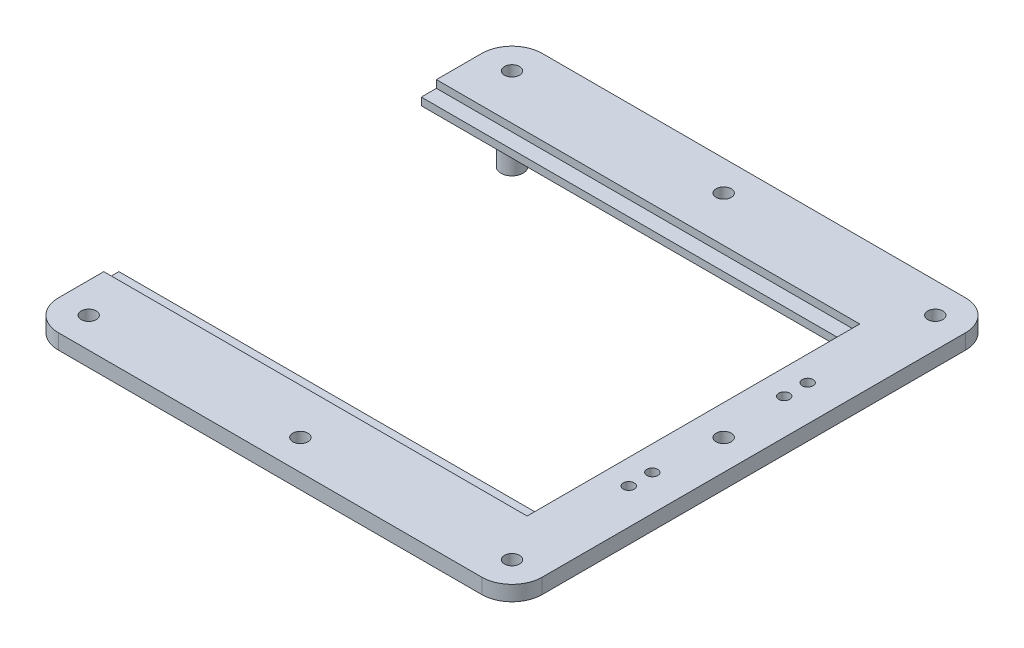
ISO-10303-21;
HEADER;
FILE_DESCRIPTION(('STEP AP214'),'2;1');
FILE_NAME('part.step','',(''),(''),'','','');
FILE_SCHEMA(('AUTOMOTIVE_DESIGN { 1 0 10303 214 1 1 1 1 }'));
ENDSEC;
DATA;
#1=APPLICATION_CONTEXT('core data for automotive mechanical design processes');
#2=APPLICATION_PROTOCOL_DEFINITION('international standard','automotive_design',2000,#1);
#3=PRODUCT_CONTEXT('',#1,'mechanical');
#4=PRODUCT('Part','Part','',(#3));
#5=PRODUCT_RELATED_PRODUCT_CATEGORY('part','',(#4));
#6=PRODUCT_DEFINITION_FORMATION('','',#4);
#7=PRODUCT_DEFINITION_CONTEXT('part definition',#1,'design');
#8=PRODUCT_DEFINITION('design','',#6,#7);
#9=PRODUCT_DEFINITION_SHAPE('','',#8);
#10=(LENGTH_UNIT() NAMED_UNIT(*) SI_UNIT(.MILLI.,.METRE.));
#11=(NAMED_UNIT(*) PLANE_ANGLE_UNIT() SI_UNIT($,.RADIAN.));
#12=(NAMED_UNIT(*) SI_UNIT($,.STERADIAN.) SOLID_ANGLE_UNIT());
#13=UNCERTAINTY_MEASURE_WITH_UNIT(LENGTH_MEASURE(1.E-05),#10,'distance_accuracy_value','');
#14=(GEOMETRIC_REPRESENTATION_CONTEXT(3) GLOBAL_UNCERTAINTY_ASSIGNED_CONTEXT((#13)) GLOBAL_UNIT_ASSIGNED_CONTEXT((#10,
#11,#12)) REPRESENTATION_CONTEXT('',''));
#15=CARTESIAN_POINT('',(0.,0.,0.));
#16=DIRECTION('',(0.,0.,1.));
#17=DIRECTION('',(1.,0.,0.));
#18=AXIS2_PLACEMENT_3D('',#15,#16,#17);
#19=CARTESIAN_POINT('',(177.8,6.35,0.));
#20=DIRECTION('',(0.,0.,-1.));
#21=DIRECTION('',(-1.,0.,0.));
#22=AXIS2_PLACEMENT_3D('',#19,#20,#21);
#23=PLANE('',#22);
#24=DIRECTION('',(0.,-1.,0.));
#25=VECTOR('',#24,1.);
#26=CARTESIAN_POINT('',(177.8,6.35,0.));
#27=LINE('',#26,#25);
#28=CARTESIAN_POINT('',(177.8,3.175,0.));
#29=VERTEX_POINT('',#28);
#30=CARTESIAN_POINT('',(177.8,0.,0.));
#31=VERTEX_POINT('',#30);
#32=EDGE_CURVE('E11',#29,#31,#27,.T.);
#33=ORIENTED_EDGE('',*,*,#32,.F.);
#34=DIRECTION('',(1.,0.,0.));
#35=VECTOR('',#34,1.);
#36=CARTESIAN_POINT('',(177.8,3.175,0.));
#37=LINE('',#36,#35);
#38=CARTESIAN_POINT('',(1.08197495753343E-13,3.175,0.));
#39=VERTEX_POINT('',#38);
#40=EDGE_CURVE('E310',#39,#29,#37,.T.);
#41=ORIENTED_EDGE('',*,*,#40,.F.);
#42=DIRECTION('',(0.,-1.,0.));
#43=VECTOR('',#42,1.);
#44=CARTESIAN_POINT('',(0.,6.35,0.));
#45=LINE('',#44,#43);
#46=CARTESIAN_POINT('',(0.,0.,0.));
#47=VERTEX_POINT('',#46);
#48=EDGE_CURVE('E109',#39,#47,#45,.T.);
#49=ORIENTED_EDGE('',*,*,#48,.T.);
#50=DIRECTION('',(1.,0.,0.));
#51=VECTOR('',#50,1.);
#52=CARTESIAN_POINT('',(177.8,0.,0.));
#53=LINE('',#52,#51);
#54=EDGE_CURVE('E169',#47,#31,#53,.T.);
#55=ORIENTED_EDGE('',*,*,#54,.T.);
#56=EDGE_LOOP('',(#33,#41,#49,#55));
#57=FACE_BOUND('',#56,.T.);
#58=ADVANCED_FACE('F38',(#57),#23,.F.);
#59=CARTESIAN_POINT('',(177.8,6.35,127.));
#60=DIRECTION('',(1.,0.,0.));
#61=DIRECTION('',(0.,0.,-1.));
#62=AXIS2_PLACEMENT_3D('',#59,#60,#61);
#63=PLANE('',#62);
#64=DIRECTION('',(0.,0.,1.));
#65=VECTOR('',#64,1.);
#66=CARTESIAN_POINT('',(177.8,0.,127.));
#67=LINE('',#66,#65);
#68=CARTESIAN_POINT('',(177.8,0.,127.));
#69=VERTEX_POINT('',#68);
#70=EDGE_CURVE('E172',#31,#69,#67,.T.);
#71=ORIENTED_EDGE('',*,*,#70,.T.);
#72=DIRECTION('',(0.,-1.,0.));
#73=VECTOR('',#72,1.);
#74=CARTESIAN_POINT('',(177.8,6.35,127.));
#75=LINE('',#74,#73);
#76=CARTESIAN_POINT('',(177.8,3.175,127.));
#77=VERTEX_POINT('',#76);
#78=EDGE_CURVE('E47',#77,#69,#75,.T.);
#79=ORIENTED_EDGE('',*,*,#78,.F.);
#80=DIRECTION('',(0.,0.,-1.));
#81=VECTOR('',#80,1.);
#82=CARTESIAN_POINT('',(177.8,3.175,127.));
#83=LINE('',#82,#81);
#84=CARTESIAN_POINT('',(177.8,3.175,133.35));
#85=VERTEX_POINT('',#84);
#86=EDGE_CURVE('E283',#85,#77,#83,.T.);
#87=ORIENTED_EDGE('',*,*,#86,.F.);
#88=DIRECTION('',(0.,1.,0.));
#89=VECTOR('',#88,1.);
#90=CARTESIAN_POINT('',(177.8,3.175,133.35));
#91=LINE('',#90,#89);
#92=CARTESIAN_POINT('',(177.8,6.35,133.35));
#93=VERTEX_POINT('',#92);
#94=EDGE_CURVE('E303',#85,#93,#91,.T.);
#95=ORIENTED_EDGE('',*,*,#94,.T.);
#96=DIRECTION('',(0.,0.,1.));
#97=VECTOR('',#96,1.);
#98=CARTESIAN_POINT('',(177.8,6.35,127.));
#99=LINE('',#98,#97);
#100=CARTESIAN_POINT('',(177.8,6.35,-6.35000000000002));
#101=VERTEX_POINT('',#100);
#102=EDGE_CURVE('E207',#101,#93,#99,.T.);
#103=ORIENTED_EDGE('',*,*,#102,.F.);
#104=DIRECTION('',(0.,1.,0.));
#105=VECTOR('',#104,1.);
#106=CARTESIAN_POINT('',(177.8,3.175,-6.35000000000002));
#107=LINE('',#106,#105);
#108=CARTESIAN_POINT('',(177.8,3.175,-6.35000000000002));
#109=VERTEX_POINT('',#108);
#110=EDGE_CURVE('E326',#109,#101,#107,.T.);
#111=ORIENTED_EDGE('',*,*,#110,.F.);
#112=DIRECTION('',(0.,0.,-1.));
#113=VECTOR('',#112,1.);
#114=CARTESIAN_POINT('',(177.8,3.175,0.));
#115=LINE('',#114,#113);
#116=EDGE_CURVE('E314',#29,#109,#115,.T.);
#117=ORIENTED_EDGE('',*,*,#116,.F.);
#118=ORIENTED_EDGE('',*,*,#32,.T.);
#119=EDGE_LOOP('',(#71,#79,#87,#95,#103,#111,#117,#118));
#120=FACE_BOUND('',#119,.T.);
#121=ADVANCED_FACE('F474',(#120),#63,.F.);
#122=CARTESIAN_POINT('',(0.,6.35,127.));
#123=DIRECTION('',(0.,0.,1.));
#124=DIRECTION('',(1.,0.,0.));
#125=AXIS2_PLACEMENT_3D('',#122,#123,#124);
#126=PLANE('',#125);
#127=DIRECTION('',(0.,-1.,0.));
#128=VECTOR('',#127,1.);
#129=CARTESIAN_POINT('',(0.,6.35,127.));
#130=LINE('',#129,#128);
#131=CARTESIAN_POINT('',(0.,3.175,127.));
#132=VERTEX_POINT('',#131);
#133=CARTESIAN_POINT('',(0.,0.,127.));
#134=VERTEX_POINT('',#133);
#135=EDGE_CURVE('E234',#132,#134,#130,.T.);
#136=ORIENTED_EDGE('',*,*,#135,.F.);
#137=DIRECTION('',(-1.,0.,0.));
#138=VECTOR('',#137,1.);
#139=CARTESIAN_POINT('',(177.8,3.175,127.));
#140=LINE('',#139,#138);
#141=EDGE_CURVE('E287',#77,#132,#140,.T.);
#142=ORIENTED_EDGE('',*,*,#141,.F.);
#143=ORIENTED_EDGE('',*,*,#78,.T.);
#144=DIRECTION('',(-1.,0.,0.));
#145=VECTOR('',#144,1.);
#146=CARTESIAN_POINT('',(0.,0.,127.));
#147=LINE('',#146,#145);
#148=EDGE_CURVE('E177',#69,#134,#147,.T.);
#149=ORIENTED_EDGE('',*,*,#148,.T.);
#150=EDGE_LOOP('',(#136,#142,#143,#149));
#151=FACE_BOUND('',#150,.T.);
#152=ADVANCED_FACE('F478',(#151),#126,.F.);
#153=CARTESIAN_POINT('',(0.,6.35,152.4));
#154=DIRECTION('',(1.,0.,0.));
#155=DIRECTION('',(0.,0.,-1.));
#156=AXIS2_PLACEMENT_3D('',#153,#154,#155);
#157=PLANE('',#156);
#158=DIRECTION('',(0.,0.,1.));
#159=VECTOR('',#158,1.);
#160=CARTESIAN_POINT('',(0.,6.35,152.4));
#161=LINE('',#160,#159);
#162=CARTESIAN_POINT('',(0.,6.35,133.35));
#163=VERTEX_POINT('',#162);
#164=CARTESIAN_POINT('',(0.,6.35,152.4));
#165=VERTEX_POINT('',#164);
#166=EDGE_CURVE('E116',#163,#165,#161,.T.);
#167=ORIENTED_EDGE('',*,*,#166,.F.);
#168=DIRECTION('',(0.,1.,0.));
#169=VECTOR('',#168,1.);
#170=CARTESIAN_POINT('',(0.,3.175,133.35));
#171=LINE('',#170,#169);
#172=CARTESIAN_POINT('',(0.,3.175,133.35));
#173=VERTEX_POINT('',#172);
#174=EDGE_CURVE('E55',#173,#163,#171,.T.);
#175=ORIENTED_EDGE('',*,*,#174,.F.);
#176=DIRECTION('',(0.,0.,1.));
#177=VECTOR('',#176,1.);
#178=CARTESIAN_POINT('',(0.,3.175,127.));
#179=LINE('',#178,#177);
#180=EDGE_CURVE('E292',#132,#173,#179,.T.);
#181=ORIENTED_EDGE('',*,*,#180,.F.);
#182=ORIENTED_EDGE('',*,*,#135,.T.);
#183=DIRECTION('',(0.,0.,1.));
#184=VECTOR('',#183,1.);
#185=CARTESIAN_POINT('',(0.,0.,152.4));
#186=LINE('',#185,#184);
#187=CARTESIAN_POINT('',(0.,0.,152.4));
#188=VERTEX_POINT('',#187);
#189=EDGE_CURVE('E181',#134,#188,#186,.T.);
#190=ORIENTED_EDGE('',*,*,#189,.T.);
#191=DIRECTION('',(0.,-1.,0.));
#192=VECTOR('',#191,1.);
#193=CARTESIAN_POINT('',(0.,6.35,152.4));
#194=LINE('',#193,#192);
#195=EDGE_CURVE('E230',#165,#188,#194,.T.);
#196=ORIENTED_EDGE('',*,*,#195,.F.);
#197=EDGE_LOOP('',(#167,#175,#181,#182,#190,#196));
#198=FACE_BOUND('',#197,.T.);
#199=ADVANCED_FACE('F805',(#198),#157,.F.);
#200=CARTESIAN_POINT('',(12.7,6.35,152.4));
#201=DIRECTION('',(0.,-1.,0.));
#202=DIRECTION('',(0.,0.,-1.));
#203=AXIS2_PLACEMENT_3D('',#200,#201,#202);
#204=CYLINDRICAL_SURFACE('',#203,12.7);
#205=CARTESIAN_POINT('',(12.7,0.,152.4));
#206=DIRECTION('',(0.,1.,0.));
#207=DIRECTION('',(0.,0.,-1.));
#208=AXIS2_PLACEMENT_3D('',#205,#206,#207);
#209=CIRCLE('',#208,12.7);
#210=CARTESIAN_POINT('',(12.7000000000001,0.,165.1));
#211=VERTEX_POINT('',#210);
#212=EDGE_CURVE('E184',#188,#211,#209,.T.);
#213=ORIENTED_EDGE('',*,*,#212,.T.);
#214=DIRECTION('',(0.,-1.,0.));
#215=VECTOR('',#214,1.);
#216=CARTESIAN_POINT('',(12.7000000000001,6.35,165.1));
#217=LINE('',#216,#215);
#218=CARTESIAN_POINT('',(12.7000000000001,6.35,165.1));
#219=VERTEX_POINT('',#218);
#220=EDGE_CURVE('E226',#219,#211,#217,.T.);
#221=ORIENTED_EDGE('',*,*,#220,.F.);
#222=CARTESIAN_POINT('',(12.7,6.35,152.4));
#223=DIRECTION('',(0.,1.,0.));
#224=DIRECTION('',(0.,0.,-1.));
#225=AXIS2_PLACEMENT_3D('',#222,#223,#224);
#226=CIRCLE('',#225,12.7);
#227=EDGE_CURVE('E402',#165,#219,#226,.T.);
#228=ORIENTED_EDGE('',*,*,#227,.F.);
#229=ORIENTED_EDGE('',*,*,#195,.T.);
#230=EDGE_LOOP('',(#213,#221,#228,#229));
#231=FACE_BOUND('',#230,.T.);
#232=ADVANCED_FACE('F813',(#231),#204,.T.);
#233=CARTESIAN_POINT('',(190.5,6.35,165.1));
#234=DIRECTION('',(0.,0.,-1.));
#235=DIRECTION('',(-1.,0.,0.));
#236=AXIS2_PLACEMENT_3D('',#233,#234,#235);
#237=PLANE('',#236);
#238=DIRECTION('',(1.,0.,0.));
#239=VECTOR('',#238,1.);
#240=CARTESIAN_POINT('',(190.5,0.,165.1));
#241=LINE('',#240,#239);
#242=CARTESIAN_POINT('',(190.5,0.,165.1));
#243=VERTEX_POINT('',#242);
#244=EDGE_CURVE('E187',#211,#243,#241,.T.);
#245=ORIENTED_EDGE('',*,*,#244,.T.);
#246=DIRECTION('',(0.,-1.,0.));
#247=VECTOR('',#246,1.);
#248=CARTESIAN_POINT('',(190.5,6.35,165.1));
#249=LINE('',#248,#247);
#250=CARTESIAN_POINT('',(190.5,6.35,165.1));
#251=VERTEX_POINT('',#250);
#252=EDGE_CURVE('E222',#251,#243,#249,.T.);
#253=ORIENTED_EDGE('',*,*,#252,.F.);
#254=DIRECTION('',(1.,0.,0.));
#255=VECTOR('',#254,1.);
#256=CARTESIAN_POINT('',(190.5,6.35,165.1));
#257=LINE('',#256,#255);
#258=EDGE_CURVE('E405',#219,#251,#257,.T.);
#259=ORIENTED_EDGE('',*,*,#258,.F.);
#260=ORIENTED_EDGE('',*,*,#220,.T.);
#261=EDGE_LOOP('',(#245,#253,#259,#260));
#262=FACE_BOUND('',#261,.T.);
#263=ADVANCED_FACE('F824',(#262),#237,.F.);
#264=CARTESIAN_POINT('',(190.5,6.35,152.4));
#265=DIRECTION('',(0.,-1.,0.));
#266=DIRECTION('',(0.,0.,-1.));
#267=AXIS2_PLACEMENT_3D('',#264,#265,#266);
#268=CYLINDRICAL_SURFACE('',#267,12.7);
#269=CARTESIAN_POINT('',(190.5,0.,152.4));
#270=DIRECTION('',(0.,1.,0.));
#271=DIRECTION('',(0.,0.,-1.));
#272=AXIS2_PLACEMENT_3D('',#269,#270,#271);
#273=CIRCLE('',#272,12.7);
#274=CARTESIAN_POINT('',(203.2,0.,152.4));
#275=VERTEX_POINT('',#274);
#276=EDGE_CURVE('E190',#243,#275,#273,.T.);
#277=ORIENTED_EDGE('',*,*,#276,.T.);
#278=DIRECTION('',(0.,-1.,0.));
#279=VECTOR('',#278,1.);
#280=CARTESIAN_POINT('',(203.2,6.35,152.4));
#281=LINE('',#280,#279);
#282=CARTESIAN_POINT('',(203.2,6.35,152.4));
#283=VERTEX_POINT('',#282);
#284=EDGE_CURVE('E218',#283,#275,#281,.T.);
#285=ORIENTED_EDGE('',*,*,#284,.F.);
#286=CARTESIAN_POINT('',(190.5,6.35,152.4));
#287=DIRECTION('',(0.,1.,0.));
#288=DIRECTION('',(0.,0.,-1.));
#289=AXIS2_PLACEMENT_3D('',#286,#287,#288);
#290=CIRCLE('',#289,12.7);
#291=EDGE_CURVE('E408',#251,#283,#290,.T.);
#292=ORIENTED_EDGE('',*,*,#291,.F.);
#293=ORIENTED_EDGE('',*,*,#252,.T.);
#294=EDGE_LOOP('',(#277,#285,#292,#293));
#295=FACE_BOUND('',#294,.T.);
#296=ADVANCED_FACE('F831',(#295),#268,.T.);
#297=CARTESIAN_POINT('',(203.2,6.35,-25.3999999999999));
#298=DIRECTION('',(-1.,0.,0.));
#299=DIRECTION('',(0.,0.,1.));
#300=AXIS2_PLACEMENT_3D('',#297,#298,#299);
#301=PLANE('',#300);
#302=DIRECTION('',(0.,0.,-1.));
#303=VECTOR('',#302,1.);
#304=CARTESIAN_POINT('',(203.2,0.,-25.3999999999999));
#305=LINE('',#304,#303);
#306=CARTESIAN_POINT('',(203.2,0.,-25.3999999999999));
#307=VERTEX_POINT('',#306);
#308=EDGE_CURVE('E193',#275,#307,#305,.T.);
#309=ORIENTED_EDGE('',*,*,#308,.T.);
#310=DIRECTION('',(0.,-1.,0.));
#311=VECTOR('',#310,1.);
#312=CARTESIAN_POINT('',(203.2,6.35,-25.3999999999999));
#313=LINE('',#312,#311);
#314=CARTESIAN_POINT('',(203.2,6.35,-25.3999999999999));
#315=VERTEX_POINT('',#314);
#316=EDGE_CURVE('E155',#315,#307,#313,.T.);
#317=ORIENTED_EDGE('',*,*,#316,.F.);
#318=DIRECTION('',(0.,0.,-1.));
#319=VECTOR('',#318,1.);
#320=CARTESIAN_POINT('',(203.2,6.35,-25.3999999999999));
#321=LINE('',#320,#319);
#322=EDGE_CURVE('E141',#283,#315,#321,.T.);
#323=ORIENTED_EDGE('',*,*,#322,.F.);
#324=ORIENTED_EDGE('',*,*,#284,.T.);
#325=EDGE_LOOP('',(#309,#317,#323,#324));
#326=FACE_BOUND('',#325,.T.);
#327=ADVANCED_FACE('F839',(#326),#301,.F.);
#328=CARTESIAN_POINT('',(190.5,6.35,-25.4));
#329=DIRECTION('',(0.,-1.,0.));
#330=DIRECTION('',(0.,0.,-1.));
#331=AXIS2_PLACEMENT_3D('',#328,#329,#330);
#332=CYLINDRICAL_SURFACE('',#331,12.7);
#333=CARTESIAN_POINT('',(190.5,0.,-25.4));
#334=DIRECTION('',(0.,1.,0.));
#335=DIRECTION('',(0.,0.,-1.));
#336=AXIS2_PLACEMENT_3D('',#333,#334,#335);
#337=CIRCLE('',#336,12.7);
#338=CARTESIAN_POINT('',(190.5,0.,-38.1));
#339=VERTEX_POINT('',#338);
#340=EDGE_CURVE('E151',#307,#339,#337,.T.);
#341=ORIENTED_EDGE('',*,*,#340,.T.);
#342=DIRECTION('',(0.,-1.,0.));
#343=VECTOR('',#342,1.);
#344=CARTESIAN_POINT('',(190.5,6.35,-38.1));
#345=LINE('',#344,#343);
#346=CARTESIAN_POINT('',(190.5,6.35,-38.1));
#347=VERTEX_POINT('',#346);
#348=EDGE_CURVE('E148',#347,#339,#345,.T.);
#349=ORIENTED_EDGE('',*,*,#348,.F.);
#350=CARTESIAN_POINT('',(190.5,6.35,-25.4));
#351=DIRECTION('',(0.,1.,0.));
#352=DIRECTION('',(0.,0.,-1.));
#353=AXIS2_PLACEMENT_3D('',#350,#351,#352);
#354=CIRCLE('',#353,12.7);
#355=EDGE_CURVE('E133',#315,#347,#354,.T.);
#356=ORIENTED_EDGE('',*,*,#355,.F.);
#357=ORIENTED_EDGE('',*,*,#316,.T.);
#358=EDGE_LOOP('',(#341,#349,#356,#357));
#359=FACE_BOUND('',#358,.T.);
#360=ADVANCED_FACE('F149',(#359),#332,.T.);
#361=CARTESIAN_POINT('',(12.7000000000001,6.35,-38.1));
#362=DIRECTION('',(0.,0.,1.));
#363=DIRECTION('',(1.,0.,0.));
#364=AXIS2_PLACEMENT_3D('',#361,#362,#363);
#365=PLANE('',#364);
#366=DIRECTION('',(-1.,0.,0.));
#367=VECTOR('',#366,1.);
#368=CARTESIAN_POINT('',(12.7000000000001,0.,-38.1));
#369=LINE('',#368,#367);
#370=CARTESIAN_POINT('',(12.7,0.,-38.1));
#371=VERTEX_POINT('',#370);
#372=EDGE_CURVE('E198',#339,#371,#369,.T.);
#373=ORIENTED_EDGE('',*,*,#372,.T.);
#374=DIRECTION('',(0.,-1.,0.));
#375=VECTOR('',#374,1.);
#376=CARTESIAN_POINT('',(12.7,6.35,-38.1));
#377=LINE('',#376,#375);
#378=CARTESIAN_POINT('',(12.7,6.35,-38.1));
#379=VERTEX_POINT('',#378);
#380=EDGE_CURVE('E156',#379,#371,#377,.T.);
#381=ORIENTED_EDGE('',*,*,#380,.F.);
#382=DIRECTION('',(-1.,0.,0.));
#383=VECTOR('',#382,1.);
#384=CARTESIAN_POINT('',(12.7000000000001,6.35,-38.1));
#385=LINE('',#384,#383);
#386=EDGE_CURVE('E138',#347,#379,#385,.T.);
#387=ORIENTED_EDGE('',*,*,#386,.F.);
#388=ORIENTED_EDGE('',*,*,#348,.T.);
#389=EDGE_LOOP('',(#373,#381,#387,#388));
#390=FACE_BOUND('',#389,.T.);
#391=ADVANCED_FACE('F158',(#390),#365,.F.);
#392=CARTESIAN_POINT('',(12.7,6.35,-25.4));
#393=DIRECTION('',(0.,-1.,0.));
#394=DIRECTION('',(0.,0.,-1.));
#395=AXIS2_PLACEMENT_3D('',#392,#393,#394);
#396=CYLINDRICAL_SURFACE('',#395,12.7);
#397=CARTESIAN_POINT('',(12.7,0.,-25.4));
#398=DIRECTION('',(0.,1.,0.));
#399=DIRECTION('',(0.,0.,-1.));
#400=AXIS2_PLACEMENT_3D('',#397,#398,#399);
#401=CIRCLE('',#400,12.7);
#402=CARTESIAN_POINT('',(0.,0.,-25.3999999999999));
#403=VERTEX_POINT('',#402);
#404=EDGE_CURVE('E201',#371,#403,#401,.T.);
#405=ORIENTED_EDGE('',*,*,#404,.T.);
#406=DIRECTION('',(0.,-1.,0.));
#407=VECTOR('',#406,1.);
#408=CARTESIAN_POINT('',(0.,6.35,-25.3999999999999));
#409=LINE('',#408,#407);
#410=CARTESIAN_POINT('',(0.,6.35,-25.3999999999999));
#411=VERTEX_POINT('',#410);
#412=EDGE_CURVE('E210',#411,#403,#409,.T.);
#413=ORIENTED_EDGE('',*,*,#412,.F.);
#414=CARTESIAN_POINT('',(12.7,6.35,-25.4));
#415=DIRECTION('',(0.,1.,0.));
#416=DIRECTION('',(0.,0.,-1.));
#417=AXIS2_PLACEMENT_3D('',#414,#415,#416);
#418=CIRCLE('',#417,12.7);
#419=EDGE_CURVE('E64',#379,#411,#418,.T.);
#420=ORIENTED_EDGE('',*,*,#419,.F.);
#421=ORIENTED_EDGE('',*,*,#380,.T.);
#422=EDGE_LOOP('',(#405,#413,#420,#421));
#423=FACE_BOUND('',#422,.T.);
#424=ADVANCED_FACE('F860',(#423),#396,.T.);
#425=CARTESIAN_POINT('',(0.,6.35,0.));
#426=DIRECTION('',(1.,0.,0.));
#427=DIRECTION('',(0.,0.,-1.));
#428=AXIS2_PLACEMENT_3D('',#425,#426,#427);
#429=PLANE('',#428);
#430=DIRECTION('',(0.,0.,1.));
#431=VECTOR('',#430,1.);
#432=CARTESIAN_POINT('',(1.08197495753343E-13,3.175,0.));
#433=LINE('',#432,#431);
#434=CARTESIAN_POINT('',(1.06356398157764E-13,3.175,-6.35000000000005));
#435=VERTEX_POINT('',#434);
#436=EDGE_CURVE('E322',#435,#39,#433,.T.);
#437=ORIENTED_EDGE('',*,*,#436,.F.);
#438=DIRECTION('',(0.,1.,0.));
#439=VECTOR('',#438,1.);
#440=CARTESIAN_POINT('',(1.06356398157764E-13,3.175,-6.35000000000005));
#441=LINE('',#440,#439);
#442=CARTESIAN_POINT('',(1.06356398157764E-13,6.35,-6.35000000000005));
#443=VERTEX_POINT('',#442);
#444=EDGE_CURVE('E302',#435,#443,#441,.T.);
#445=ORIENTED_EDGE('',*,*,#444,.T.);
#446=DIRECTION('',(0.,0.,1.));
#447=VECTOR('',#446,1.);
#448=CARTESIAN_POINT('',(0.,6.35,0.));
#449=LINE('',#448,#447);
#450=EDGE_CURVE('E163',#411,#443,#449,.T.);
#451=ORIENTED_EDGE('',*,*,#450,.F.);
#452=ORIENTED_EDGE('',*,*,#412,.T.);
#453=DIRECTION('',(0.,0.,1.));
#454=VECTOR('',#453,1.);
#455=CARTESIAN_POINT('',(0.,0.,0.));
#456=LINE('',#455,#454);
#457=EDGE_CURVE('E204',#403,#47,#456,.T.);
#458=ORIENTED_EDGE('',*,*,#457,.T.);
#459=ORIENTED_EDGE('',*,*,#48,.F.);
#460=EDGE_LOOP('',(#437,#445,#451,#452,#458,#459));
#461=FACE_BOUND('',#460,.T.);
#462=ADVANCED_FACE('F436',(#461),#429,.F.);
#463=CARTESIAN_POINT('',(12.7,6.35,-25.4));
#464=DIRECTION('',(0.,-1.,0.));
#465=DIRECTION('',(0.,0.,-1.));
#466=AXIS2_PLACEMENT_3D('',#463,#464,#465);
#467=PLANE('',#466);
#468=CARTESIAN_POINT('',(101.6,6.35,-25.4));
#469=DIRECTION('',(0.,1.,0.));
#470=DIRECTION('',(0.,0.,1.));
#471=AXIS2_PLACEMENT_3D('',#468,#469,#470);
#472=CIRCLE('',#471,3.175);
#473=CARTESIAN_POINT('',(101.6,6.35,-22.225));
#474=VERTEX_POINT('',#473);
#475=EDGE_CURVE('E261',#474,#474,#472,.T.);
#476=ORIENTED_EDGE('',*,*,#475,.F.);
#477=EDGE_LOOP('',(#476));
#478=FACE_BOUND('',#477,.T.);
#479=CARTESIAN_POINT('',(190.500000000001,6.35,63.4999999999985));
#480=DIRECTION('',(0.,1.,0.));
#481=DIRECTION('',(0.,0.,1.));
#482=AXIS2_PLACEMENT_3D('',#479,#480,#481);
#483=CIRCLE('',#482,3.175);
#484=CARTESIAN_POINT('',(190.500000000001,6.35,66.6749999999985));
#485=VERTEX_POINT('',#484);
#486=EDGE_CURVE('E423',#485,#485,#483,.T.);
#487=ORIENTED_EDGE('',*,*,#486,.F.);
#488=EDGE_LOOP('',(#487));
#489=FACE_BOUND('',#488,.T.);
#490=CARTESIAN_POINT('',(101.600000000003,6.35,152.4));
#491=DIRECTION('',(0.,1.,0.));
#492=DIRECTION('',(0.,0.,1.));
#493=AXIS2_PLACEMENT_3D('',#490,#491,#492);
#494=CIRCLE('',#493,3.175);
#495=CARTESIAN_POINT('',(101.600000000003,6.35,155.575));
#496=VERTEX_POINT('',#495);
#497=EDGE_CURVE('E419',#496,#496,#494,.T.);
#498=ORIENTED_EDGE('',*,*,#497,.F.);
#499=EDGE_LOOP('',(#498));
#500=FACE_BOUND('',#499,.T.);
#501=CARTESIAN_POINT('',(188.214,6.35,101.092));
#502=DIRECTION('',(0.,1.,0.));
#503=DIRECTION('',(0.,0.,1.));
#504=AXIS2_PLACEMENT_3D('',#501,#502,#503);
#505=CIRCLE('',#504,2.28600000000001);
#506=CARTESIAN_POINT('',(188.214,6.35,103.378));
#507=VERTEX_POINT('',#506);
#508=EDGE_CURVE('E244',#507,#507,#505,.T.);
#509=ORIENTED_EDGE('',*,*,#508,.F.);
#510=EDGE_LOOP('',(#509));
#511=FACE_BOUND('',#510,.T.);
#512=CARTESIAN_POINT('',(188.214,6.35,91.186));
#513=DIRECTION('',(0.,1.,0.));
#514=DIRECTION('',(0.,0.,1.));
#515=AXIS2_PLACEMENT_3D('',#512,#513,#514);
#516=CIRCLE('',#515,2.28600000000001);
#517=CARTESIAN_POINT('',(188.214,6.35,93.472));
#518=VERTEX_POINT('',#517);
#519=EDGE_CURVE('E279',#518,#518,#516,.T.);
#520=ORIENTED_EDGE('',*,*,#519,.F.);
#521=EDGE_LOOP('',(#520));
#522=FACE_BOUND('',#521,.T.);
#523=CARTESIAN_POINT('',(188.214,6.35,35.814));
#524=DIRECTION('',(0.,1.,0.));
#525=DIRECTION('',(0.,0.,1.));
#526=AXIS2_PLACEMENT_3D('',#523,#524,#525);
#527=CIRCLE('',#526,2.28600000000001);
#528=CARTESIAN_POINT('',(188.214,6.35,38.1));
#529=VERTEX_POINT('',#528);
#530=EDGE_CURVE('E273',#529,#529,#527,.T.);
#531=ORIENTED_EDGE('',*,*,#530,.F.);
#532=EDGE_LOOP('',(#531));
#533=FACE_BOUND('',#532,.T.);
#534=CARTESIAN_POINT('',(188.214,6.35,25.908));
#535=DIRECTION('',(0.,1.,0.));
#536=DIRECTION('',(0.,0.,1.));
#537=AXIS2_PLACEMENT_3D('',#534,#535,#536);
#538=CIRCLE('',#537,2.28600000000001);
#539=CARTESIAN_POINT('',(188.214,6.35,28.194));
#540=VERTEX_POINT('',#539);
#541=EDGE_CURVE('E268',#540,#540,#538,.T.);
#542=ORIENTED_EDGE('',*,*,#541,.F.);
#543=EDGE_LOOP('',(#542));
#544=FACE_BOUND('',#543,.T.);
#545=CARTESIAN_POINT('',(12.7,6.35,152.4));
#546=DIRECTION('',(0.,1.,0.));
#547=DIRECTION('',(0.,0.,1.));
#548=AXIS2_PLACEMENT_3D('',#545,#546,#547);
#549=CIRCLE('',#548,3.175);
#550=CARTESIAN_POINT('',(12.7,6.35,155.575));
#551=VERTEX_POINT('',#550);
#552=EDGE_CURVE('E364',#551,#551,#549,.T.);
#553=ORIENTED_EDGE('',*,*,#552,.F.);
#554=EDGE_LOOP('',(#553));
#555=FACE_BOUND('',#554,.T.);
#556=CARTESIAN_POINT('',(190.5,6.35,152.4));
#557=DIRECTION('',(0.,1.,0.));
#558=DIRECTION('',(0.,0.,1.));
#559=AXIS2_PLACEMENT_3D('',#556,#557,#558);
#560=CIRCLE('',#559,3.175);
#561=CARTESIAN_POINT('',(190.5,6.35,155.575));
#562=VERTEX_POINT('',#561);
#563=EDGE_CURVE('E381',#562,#562,#560,.T.);
#564=ORIENTED_EDGE('',*,*,#563,.F.);
#565=EDGE_LOOP('',(#564));
#566=FACE_BOUND('',#565,.T.);
#567=CARTESIAN_POINT('',(190.5,6.35,-25.4));
#568=DIRECTION('',(0.,1.,0.));
#569=DIRECTION('',(0.,0.,1.));
#570=AXIS2_PLACEMENT_3D('',#567,#568,#569);
#571=CIRCLE('',#570,3.175);
#572=CARTESIAN_POINT('',(190.5,6.35,-22.225));
#573=VERTEX_POINT('',#572);
#574=EDGE_CURVE('E373',#573,#573,#571,.T.);
#575=ORIENTED_EDGE('',*,*,#574,.F.);
#576=EDGE_LOOP('',(#575));
#577=FACE_BOUND('',#576,.T.);
#578=CARTESIAN_POINT('',(12.7,6.35,-25.4));
#579=DIRECTION('',(0.,1.,0.));
#580=DIRECTION('',(0.,0.,1.));
#581=AXIS2_PLACEMENT_3D('',#578,#579,#580);
#582=CIRCLE('',#581,3.175);
#583=CARTESIAN_POINT('',(12.7,6.35,-22.225));
#584=VERTEX_POINT('',#583);
#585=EDGE_CURVE('E372',#584,#584,#582,.T.);
#586=ORIENTED_EDGE('',*,*,#585,.F.);
#587=EDGE_LOOP('',(#586));
#588=FACE_BOUND('',#587,.T.);
#589=ORIENTED_EDGE('',*,*,#102,.T.);
#590=DIRECTION('',(1.,0.,0.));
#591=VECTOR('',#590,1.);
#592=CARTESIAN_POINT('',(177.8,6.35,133.35));
#593=LINE('',#592,#591);
#594=EDGE_CURVE('E288',#163,#93,#593,.T.);
#595=ORIENTED_EDGE('',*,*,#594,.F.);
#596=ORIENTED_EDGE('',*,*,#166,.T.);
#597=ORIENTED_EDGE('',*,*,#227,.T.);
#598=ORIENTED_EDGE('',*,*,#258,.T.);
#599=ORIENTED_EDGE('',*,*,#291,.T.);
#600=ORIENTED_EDGE('',*,*,#322,.T.);
#601=ORIENTED_EDGE('',*,*,#355,.T.);
#602=ORIENTED_EDGE('',*,*,#386,.T.);
#603=ORIENTED_EDGE('',*,*,#419,.T.);
#604=ORIENTED_EDGE('',*,*,#450,.T.);
#605=DIRECTION('',(-1.,0.,0.));
#606=VECTOR('',#605,1.);
#607=CARTESIAN_POINT('',(177.8,6.35,-6.35000000000002));
#608=LINE('',#607,#606);
#609=EDGE_CURVE('E256',#101,#443,#608,.T.);
#610=ORIENTED_EDGE('',*,*,#609,.F.);
#611=EDGE_LOOP('',(#589,#595,#596,#597,#598,#599,#600,#601,#602,#603,#604,#610));
#612=FACE_BOUND('',#611,.T.);
#613=ADVANCED_FACE('F136',(#478,#489,#500,#511,#522,#533,#544,#555,#566,#577,#588,#612),#467,.F.);
#614=CARTESIAN_POINT('',(12.7,0.,-25.4));
#615=DIRECTION('',(0.,-1.,0.));
#616=DIRECTION('',(0.,0.,-1.));
#617=AXIS2_PLACEMENT_3D('',#614,#615,#616);
#618=PLANE('',#617);
#619=CARTESIAN_POINT('',(101.6,0.,-25.4));
#620=DIRECTION('',(0.,-1.,0.));
#621=DIRECTION('',(0.,0.,-1.));
#622=AXIS2_PLACEMENT_3D('',#619,#620,#621);
#623=CIRCLE('',#622,3.175);
#624=CARTESIAN_POINT('',(101.6,0.,-28.575));
#625=VERTEX_POINT('',#624);
#626=EDGE_CURVE('E41',#625,#625,#623,.T.);
#627=ORIENTED_EDGE('',*,*,#626,.F.);
#628=EDGE_LOOP('',(#627));
#629=FACE_BOUND('',#628,.T.);
#630=CARTESIAN_POINT('',(190.500000000001,0.,63.4999999999985));
#631=DIRECTION('',(0.,-1.,0.));
#632=DIRECTION('',(0.,0.,-1.));
#633=AXIS2_PLACEMENT_3D('',#630,#631,#632);
#634=CIRCLE('',#633,3.175);
#635=CARTESIAN_POINT('',(190.500000000001,0.,60.3249999999985));
#636=VERTEX_POINT('',#635);
#637=EDGE_CURVE('E260',#636,#636,#634,.T.);
#638=ORIENTED_EDGE('',*,*,#637,.F.);
#639=EDGE_LOOP('',(#638));
#640=FACE_BOUND('',#639,.T.);
#641=CARTESIAN_POINT('',(101.600000000003,0.,152.4));
#642=DIRECTION('',(0.,-1.,0.));
#643=DIRECTION('',(0.,0.,-1.));
#644=AXIS2_PLACEMENT_3D('',#641,#642,#643);
#645=CIRCLE('',#644,3.175);
#646=CARTESIAN_POINT('',(101.600000000003,0.,149.225));
#647=VERTEX_POINT('',#646);
#648=EDGE_CURVE('E257',#647,#647,#645,.T.);
#649=ORIENTED_EDGE('',*,*,#648,.F.);
#650=EDGE_LOOP('',(#649));
#651=FACE_BOUND('',#650,.T.);
#652=CARTESIAN_POINT('',(188.214,0.,101.092));
#653=DIRECTION('',(0.,-1.,0.));
#654=DIRECTION('',(0.,0.,-1.));
#655=AXIS2_PLACEMENT_3D('',#652,#653,#654);
#656=CIRCLE('',#655,2.28600000000001);
#657=CARTESIAN_POINT('',(188.214,0.,98.806));
#658=VERTEX_POINT('',#657);
#659=EDGE_CURVE('E252',#658,#658,#656,.T.);
#660=ORIENTED_EDGE('',*,*,#659,.F.);
#661=EDGE_LOOP('',(#660));
#662=FACE_BOUND('',#661,.T.);
#663=CARTESIAN_POINT('',(188.214,0.,91.186));
#664=DIRECTION('',(0.,-1.,0.));
#665=DIRECTION('',(0.,0.,-1.));
#666=AXIS2_PLACEMENT_3D('',#663,#664,#665);
#667=CIRCLE('',#666,2.28600000000001);
#668=CARTESIAN_POINT('',(188.214,0.,88.9));
#669=VERTEX_POINT('',#668);
#670=EDGE_CURVE('E248',#669,#669,#667,.T.);
#671=ORIENTED_EDGE('',*,*,#670,.F.);
#672=EDGE_LOOP('',(#671));
#673=FACE_BOUND('',#672,.T.);
#674=CARTESIAN_POINT('',(188.214,0.,35.814));
#675=DIRECTION('',(0.,-1.,0.));
#676=DIRECTION('',(0.,0.,-1.));
#677=AXIS2_PLACEMENT_3D('',#674,#675,#676);
#678=CIRCLE('',#677,2.28600000000001);
#679=CARTESIAN_POINT('',(188.214,0.,33.528));
#680=VERTEX_POINT('',#679);
#681=EDGE_CURVE('E243',#680,#680,#678,.T.);
#682=ORIENTED_EDGE('',*,*,#681,.F.);
#683=EDGE_LOOP('',(#682));
#684=FACE_BOUND('',#683,.T.);
#685=CARTESIAN_POINT('',(188.214,0.,25.908));
#686=DIRECTION('',(0.,-1.,0.));
#687=DIRECTION('',(0.,0.,-1.));
#688=AXIS2_PLACEMENT_3D('',#685,#686,#687);
#689=CIRCLE('',#688,2.28600000000001);
#690=CARTESIAN_POINT('',(188.214,0.,23.622));
#691=VERTEX_POINT('',#690);
#692=EDGE_CURVE('E239',#691,#691,#689,.T.);
#693=ORIENTED_EDGE('',*,*,#692,.F.);
#694=EDGE_LOOP('',(#693));
#695=FACE_BOUND('',#694,.T.);
#696=CARTESIAN_POINT('',(28.5750000000001,0.,-9.52500000000006));
#697=DIRECTION('',(0.,-1.,0.));
#698=DIRECTION('',(0.,0.,1.));
#699=AXIS2_PLACEMENT_3D('',#696,#697,#698);
#700=CIRCLE('',#699,4.6625);
#701=CARTESIAN_POINT('',(28.5750000000001,0.,-4.86250000000006));
#702=VERTEX_POINT('',#701);
#703=EDGE_CURVE('E307',#702,#702,#700,.T.);
#704=ORIENTED_EDGE('',*,*,#703,.F.);
#705=EDGE_LOOP('',(#704));
#706=FACE_BOUND('',#705,.T.);
#707=CARTESIAN_POINT('',(174.625,0.,-9.52500000000006));
#708=DIRECTION('',(0.,-1.,0.));
#709=DIRECTION('',(0.,0.,1.));
#710=AXIS2_PLACEMENT_3D('',#707,#708,#709);
#711=CIRCLE('',#710,4.66249999999996);
#712=CARTESIAN_POINT('',(174.625,0.,-4.8625000000001));
#713=VERTEX_POINT('',#712);
#714=EDGE_CURVE('E340',#713,#713,#711,.T.);
#715=ORIENTED_EDGE('',*,*,#714,.F.);
#716=EDGE_LOOP('',(#715));
#717=FACE_BOUND('',#716,.T.);
#718=CARTESIAN_POINT('',(174.625,0.,136.525));
#719=DIRECTION('',(0.,-1.,0.));
#720=DIRECTION('',(0.,0.,-1.));
#721=AXIS2_PLACEMENT_3D('',#718,#719,#720);
#722=CIRCLE('',#721,4.66249999999999);
#723=CARTESIAN_POINT('',(174.625,0.,131.8625));
#724=VERTEX_POINT('',#723);
#725=EDGE_CURVE('E348',#724,#724,#722,.T.);
#726=ORIENTED_EDGE('',*,*,#725,.F.);
#727=EDGE_LOOP('',(#726));
#728=FACE_BOUND('',#727,.T.);
#729=CARTESIAN_POINT('',(28.575,0.,136.525));
#730=DIRECTION('',(0.,-1.,0.));
#731=DIRECTION('',(0.,0.,-1.));
#732=AXIS2_PLACEMENT_3D('',#729,#730,#731);
#733=CIRCLE('',#732,4.6625);
#734=CARTESIAN_POINT('',(28.575,0.,131.8625));
#735=VERTEX_POINT('',#734);
#736=EDGE_CURVE('E356',#735,#735,#733,.T.);
#737=ORIENTED_EDGE('',*,*,#736,.F.);
#738=EDGE_LOOP('',(#737));
#739=FACE_BOUND('',#738,.T.);
#740=CARTESIAN_POINT('',(12.7,0.,152.4));
#741=DIRECTION('',(0.,1.,0.));
#742=DIRECTION('',(0.,0.,1.));
#743=AXIS2_PLACEMENT_3D('',#740,#741,#742);
#744=CIRCLE('',#743,3.175);
#745=CARTESIAN_POINT('',(12.7,0.,155.575));
#746=VERTEX_POINT('',#745);
#747=EDGE_CURVE('E385',#746,#746,#744,.T.);
#748=ORIENTED_EDGE('',*,*,#747,.T.);
#749=EDGE_LOOP('',(#748));
#750=FACE_BOUND('',#749,.T.);
#751=CARTESIAN_POINT('',(190.5,0.,152.4));
#752=DIRECTION('',(0.,1.,0.));
#753=DIRECTION('',(0.,0.,1.));
#754=AXIS2_PLACEMENT_3D('',#751,#752,#753);
#755=CIRCLE('',#754,3.175);
#756=CARTESIAN_POINT('',(190.5,0.,155.575));
#757=VERTEX_POINT('',#756);
#758=EDGE_CURVE('E377',#757,#757,#755,.T.);
#759=ORIENTED_EDGE('',*,*,#758,.T.);
#760=EDGE_LOOP('',(#759));
#761=FACE_BOUND('',#760,.T.);
#762=CARTESIAN_POINT('',(190.5,0.,-25.4));
#763=DIRECTION('',(0.,1.,0.));
#764=DIRECTION('',(0.,0.,1.));
#765=AXIS2_PLACEMENT_3D('',#762,#763,#764);
#766=CIRCLE('',#765,3.175);
#767=CARTESIAN_POINT('',(190.5,0.,-22.225));
#768=VERTEX_POINT('',#767);
#769=EDGE_CURVE('E368',#768,#768,#766,.T.);
#770=ORIENTED_EDGE('',*,*,#769,.T.);
#771=EDGE_LOOP('',(#770));
#772=FACE_BOUND('',#771,.T.);
#773=CARTESIAN_POINT('',(12.7,0.,-25.4));
#774=DIRECTION('',(0.,1.,0.));
#775=DIRECTION('',(0.,0.,1.));
#776=AXIS2_PLACEMENT_3D('',#773,#774,#775);
#777=CIRCLE('',#776,3.175);
#778=CARTESIAN_POINT('',(12.7,0.,-22.225));
#779=VERTEX_POINT('',#778);
#780=EDGE_CURVE('E173',#779,#779,#777,.T.);
#781=ORIENTED_EDGE('',*,*,#780,.T.);
#782=EDGE_LOOP('',(#781));
#783=FACE_BOUND('',#782,.T.);
#784=ORIENTED_EDGE('',*,*,#54,.F.);
#785=ORIENTED_EDGE('',*,*,#457,.F.);
#786=ORIENTED_EDGE('',*,*,#404,.F.);
#787=ORIENTED_EDGE('',*,*,#372,.F.);
#788=ORIENTED_EDGE('',*,*,#340,.F.);
#789=ORIENTED_EDGE('',*,*,#308,.F.);
#790=ORIENTED_EDGE('',*,*,#276,.F.);
#791=ORIENTED_EDGE('',*,*,#244,.F.);
#792=ORIENTED_EDGE('',*,*,#212,.F.);
#793=ORIENTED_EDGE('',*,*,#189,.F.);
#794=ORIENTED_EDGE('',*,*,#148,.F.);
#795=ORIENTED_EDGE('',*,*,#70,.F.);
#796=EDGE_LOOP('',(#784,#785,#786,#787,#788,#789,#790,#791,#792,#793,#794,#795));
#797=FACE_BOUND('',#796,.T.);
#798=ADVANCED_FACE('F435',(#629,#640,#651,#662,#673,#684,#695,#706,#717,#728,#739,#750,#761,
#772,#783,#797),#618,.T.);
#799=CARTESIAN_POINT('',(12.7,0.,-25.4));
#800=DIRECTION('',(0.,1.,0.));
#801=DIRECTION('',(0.,0.,1.));
#802=AXIS2_PLACEMENT_3D('',#799,#800,#801);
#803=CYLINDRICAL_SURFACE('',#802,3.175);
#804=ORIENTED_EDGE('',*,*,#780,.F.);
#805=EDGE_LOOP('',(#804));
#806=FACE_BOUND('',#805,.T.);
#807=ORIENTED_EDGE('',*,*,#585,.T.);
#808=EDGE_LOOP('',(#807));
#809=FACE_BOUND('',#808,.T.);
#810=ADVANCED_FACE('F456',(#806,#809),#803,.F.);
#811=CARTESIAN_POINT('',(190.5,0.,-25.4));
#812=DIRECTION('',(0.,1.,0.));
#813=DIRECTION('',(0.,0.,1.));
#814=AXIS2_PLACEMENT_3D('',#811,#812,#813);
#815=CYLINDRICAL_SURFACE('',#814,3.175);
#816=ORIENTED_EDGE('',*,*,#769,.F.);
#817=EDGE_LOOP('',(#816));
#818=FACE_BOUND('',#817,.T.);
#819=ORIENTED_EDGE('',*,*,#574,.T.);
#820=EDGE_LOOP('',(#819));
#821=FACE_BOUND('',#820,.T.);
#822=ADVANCED_FACE('F458',(#818,#821),#815,.F.);
#823=CARTESIAN_POINT('',(190.5,0.,152.4));
#824=DIRECTION('',(0.,1.,0.));
#825=DIRECTION('',(0.,0.,1.));
#826=AXIS2_PLACEMENT_3D('',#823,#824,#825);
#827=CYLINDRICAL_SURFACE('',#826,3.175);
#828=ORIENTED_EDGE('',*,*,#758,.F.);
#829=EDGE_LOOP('',(#828));
#830=FACE_BOUND('',#829,.T.);
#831=ORIENTED_EDGE('',*,*,#563,.T.);
#832=EDGE_LOOP('',(#831));
#833=FACE_BOUND('',#832,.T.);
#834=ADVANCED_FACE('F465',(#830,#833),#827,.F.);
#835=CARTESIAN_POINT('',(12.7,0.,152.4));
#836=DIRECTION('',(0.,1.,0.));
#837=DIRECTION('',(0.,0.,1.));
#838=AXIS2_PLACEMENT_3D('',#835,#836,#837);
#839=CYLINDRICAL_SURFACE('',#838,3.175);
#840=ORIENTED_EDGE('',*,*,#747,.F.);
#841=EDGE_LOOP('',(#840));
#842=FACE_BOUND('',#841,.T.);
#843=ORIENTED_EDGE('',*,*,#552,.T.);
#844=EDGE_LOOP('',(#843));
#845=FACE_BOUND('',#844,.T.);
#846=ADVANCED_FACE('F568',(#842,#845),#839,.F.);
#847=CARTESIAN_POINT('',(28.575,-12.7,136.525));
#848=DIRECTION('',(0.,1.,0.));
#849=DIRECTION('',(0.,0.,1.));
#850=AXIS2_PLACEMENT_3D('',#847,#848,#849);
#851=CYLINDRICAL_SURFACE('',#850,4.6625);
#852=CARTESIAN_POINT('',(28.575,-12.7,136.525));
#853=DIRECTION('',(0.,-1.,0.));
#854=DIRECTION('',(0.,0.,-1.));
#855=AXIS2_PLACEMENT_3D('',#852,#853,#854);
#856=CIRCLE('',#855,4.6625);
#857=CARTESIAN_POINT('',(28.575,-12.7,131.8625));
#858=VERTEX_POINT('',#857);
#859=EDGE_CURVE('E360',#858,#858,#856,.T.);
#860=ORIENTED_EDGE('',*,*,#859,.F.);
#861=EDGE_LOOP('',(#860));
#862=FACE_BOUND('',#861,.T.);
#863=ORIENTED_EDGE('',*,*,#736,.T.);
#864=EDGE_LOOP('',(#863));
#865=FACE_BOUND('',#864,.T.);
#866=ADVANCED_FACE('F565',(#862,#865),#851,.T.);
#867=CARTESIAN_POINT('',(28.575,-12.7,136.525));
#868=DIRECTION('',(0.,-1.,0.));
#869=DIRECTION('',(0.,0.,-1.));
#870=AXIS2_PLACEMENT_3D('',#867,#868,#869);
#871=PLANE('',#870);
#872=ORIENTED_EDGE('',*,*,#859,.T.);
#873=EDGE_LOOP('',(#872));
#874=FACE_BOUND('',#873,.T.);
#875=ADVANCED_FACE('F561',(#874),#871,.T.);
#876=CARTESIAN_POINT('',(174.625,-12.7,136.525));
#877=DIRECTION('',(0.,1.,0.));
#878=DIRECTION('',(0.,0.,1.));
#879=AXIS2_PLACEMENT_3D('',#876,#877,#878);
#880=CYLINDRICAL_SURFACE('',#879,4.66249999999999);
#881=CARTESIAN_POINT('',(174.625,-12.7,136.525));
#882=DIRECTION('',(0.,-1.,0.));
#883=DIRECTION('',(0.,0.,-1.));
#884=AXIS2_PLACEMENT_3D('',#881,#882,#883);
#885=CIRCLE('',#884,4.66249999999999);
#886=CARTESIAN_POINT('',(174.625,-12.7,131.8625));
#887=VERTEX_POINT('',#886);
#888=EDGE_CURVE('E352',#887,#887,#885,.T.);
#889=ORIENTED_EDGE('',*,*,#888,.F.);
#890=EDGE_LOOP('',(#889));
#891=FACE_BOUND('',#890,.T.);
#892=ORIENTED_EDGE('',*,*,#725,.T.);
#893=EDGE_LOOP('',(#892));
#894=FACE_BOUND('',#893,.T.);
#895=ADVANCED_FACE('F557',(#891,#894),#880,.T.);
#896=CARTESIAN_POINT('',(174.625,-12.7,136.525));
#897=DIRECTION('',(0.,-1.,0.));
#898=DIRECTION('',(0.,0.,-1.));
#899=AXIS2_PLACEMENT_3D('',#896,#897,#898);
#900=PLANE('',#899);
#901=ORIENTED_EDGE('',*,*,#888,.T.);
#902=EDGE_LOOP('',(#901));
#903=FACE_BOUND('',#902,.T.);
#904=ADVANCED_FACE('F553',(#903),#900,.T.);
#905=CARTESIAN_POINT('',(174.625,-12.7,-9.52500000000006));
#906=DIRECTION('',(0.,1.,0.));
#907=DIRECTION('',(0.,0.,1.));
#908=AXIS2_PLACEMENT_3D('',#905,#906,#907);
#909=CYLINDRICAL_SURFACE('',#908,4.66249999999996);
#910=CARTESIAN_POINT('',(174.625,-12.7,-9.52500000000006));
#911=DIRECTION('',(0.,-1.,0.));
#912=DIRECTION('',(0.,0.,1.));
#913=AXIS2_PLACEMENT_3D('',#910,#911,#912);
#914=CIRCLE('',#913,4.66249999999996);
#915=CARTESIAN_POINT('',(174.625,-12.7,-4.8625000000001));
#916=VERTEX_POINT('',#915);
#917=EDGE_CURVE('E344',#916,#916,#914,.T.);
#918=ORIENTED_EDGE('',*,*,#917,.F.);
#919=EDGE_LOOP('',(#918));
#920=FACE_BOUND('',#919,.T.);
#921=ORIENTED_EDGE('',*,*,#714,.T.);
#922=EDGE_LOOP('',(#921));
#923=FACE_BOUND('',#922,.T.);
#924=ADVANCED_FACE('F549',(#920,#923),#909,.T.);
#925=CARTESIAN_POINT('',(174.625,-12.7,-9.52500000000006));
#926=DIRECTION('',(0.,1.,0.));
#927=DIRECTION('',(0.,0.,1.));
#928=AXIS2_PLACEMENT_3D('',#925,#926,#927);
#929=PLANE('',#928);
#930=ORIENTED_EDGE('',*,*,#917,.T.);
#931=EDGE_LOOP('',(#930));
#932=FACE_BOUND('',#931,.T.);
#933=ADVANCED_FACE('F545',(#932),#929,.F.);
#934=CARTESIAN_POINT('',(28.5750000000001,-12.7,-9.52500000000006));
#935=DIRECTION('',(0.,1.,0.));
#936=DIRECTION('',(0.,0.,1.));
#937=AXIS2_PLACEMENT_3D('',#934,#935,#936);
#938=CYLINDRICAL_SURFACE('',#937,4.6625);
#939=CARTESIAN_POINT('',(28.5750000000001,-12.7,-9.52500000000006));
#940=DIRECTION('',(0.,-1.,0.));
#941=DIRECTION('',(0.,0.,1.));
#942=AXIS2_PLACEMENT_3D('',#939,#940,#941);
#943=CIRCLE('',#942,4.6625);
#944=CARTESIAN_POINT('',(28.5750000000001,-12.7,-4.86250000000006));
#945=VERTEX_POINT('',#944);
#946=EDGE_CURVE('E336',#945,#945,#943,.T.);
#947=ORIENTED_EDGE('',*,*,#946,.F.);
#948=EDGE_LOOP('',(#947));
#949=FACE_BOUND('',#948,.T.);
#950=ORIENTED_EDGE('',*,*,#703,.T.);
#951=EDGE_LOOP('',(#950));
#952=FACE_BOUND('',#951,.T.);
#953=ADVANCED_FACE('F541',(#949,#952),#938,.T.);
#954=CARTESIAN_POINT('',(28.5750000000001,-12.7,-9.52500000000006));
#955=DIRECTION('',(0.,1.,0.));
#956=DIRECTION('',(0.,0.,1.));
#957=AXIS2_PLACEMENT_3D('',#954,#955,#956);
#958=PLANE('',#957);
#959=ORIENTED_EDGE('',*,*,#946,.T.);
#960=EDGE_LOOP('',(#959));
#961=FACE_BOUND('',#960,.T.);
#962=ADVANCED_FACE('F535',(#961),#958,.F.);
#963=CARTESIAN_POINT('',(177.8,3.175,-6.35000000000002));
#964=DIRECTION('',(0.,0.,-1.));
#965=DIRECTION('',(-1.,0.,0.));
#966=AXIS2_PLACEMENT_3D('',#963,#964,#965);
#967=PLANE('',#966);
#968=ORIENTED_EDGE('',*,*,#609,.T.);
#969=ORIENTED_EDGE('',*,*,#444,.F.);
#970=DIRECTION('',(-1.,0.,0.));
#971=VECTOR('',#970,1.);
#972=CARTESIAN_POINT('',(177.8,3.175,-6.35000000000002));
#973=LINE('',#972,#971);
#974=EDGE_CURVE('E318',#109,#435,#973,.T.);
#975=ORIENTED_EDGE('',*,*,#974,.F.);
#976=ORIENTED_EDGE('',*,*,#110,.T.);
#977=EDGE_LOOP('',(#968,#969,#975,#976));
#978=FACE_BOUND('',#977,.T.);
#979=ADVANCED_FACE('F519',(#978),#967,.F.);
#980=CARTESIAN_POINT('',(0.,3.175,0.));
#981=DIRECTION('',(0.,-1.,0.));
#982=DIRECTION('',(0.,0.,-1.));
#983=AXIS2_PLACEMENT_3D('',#980,#981,#982);
#984=PLANE('',#983);
#985=ORIENTED_EDGE('',*,*,#40,.T.);
#986=ORIENTED_EDGE('',*,*,#116,.T.);
#987=ORIENTED_EDGE('',*,*,#974,.T.);
#988=ORIENTED_EDGE('',*,*,#436,.T.);
#989=EDGE_LOOP('',(#985,#986,#987,#988));
#990=FACE_BOUND('',#989,.T.);
#991=ADVANCED_FACE('F525',(#990),#984,.F.);
#992=CARTESIAN_POINT('',(177.8,3.175,133.35));
#993=DIRECTION('',(0.,0.,1.));
#994=DIRECTION('',(1.,0.,0.));
#995=AXIS2_PLACEMENT_3D('',#992,#993,#994);
#996=PLANE('',#995);
#997=ORIENTED_EDGE('',*,*,#594,.T.);
#998=ORIENTED_EDGE('',*,*,#94,.F.);
#999=DIRECTION('',(1.,0.,0.));
#1000=VECTOR('',#999,1.);
#1001=CARTESIAN_POINT('',(177.8,3.175,133.35));
#1002=LINE('',#1001,#1000);
#1003=EDGE_CURVE('E296',#173,#85,#1002,.T.);
#1004=ORIENTED_EDGE('',*,*,#1003,.F.);
#1005=ORIENTED_EDGE('',*,*,#174,.T.);
#1006=EDGE_LOOP('',(#997,#998,#1004,#1005));
#1007=FACE_BOUND('',#1006,.T.);
#1008=ADVANCED_FACE('F527',(#1007),#996,.F.);
#1009=CARTESIAN_POINT('',(0.,3.175,0.));
#1010=DIRECTION('',(0.,-1.,0.));
#1011=DIRECTION('',(0.,0.,-1.));
#1012=AXIS2_PLACEMENT_3D('',#1009,#1010,#1011);
#1013=PLANE('',#1012);
#1014=ORIENTED_EDGE('',*,*,#86,.T.);
#1015=ORIENTED_EDGE('',*,*,#141,.T.);
#1016=ORIENTED_EDGE('',*,*,#180,.T.);
#1017=ORIENTED_EDGE('',*,*,#1003,.T.);
#1018=EDGE_LOOP('',(#1014,#1015,#1016,#1017));
#1019=FACE_BOUND('',#1018,.T.);
#1020=ADVANCED_FACE('F533',(#1019),#1013,.F.);
#1021=CARTESIAN_POINT('',(188.214,-6.35,25.908));
#1022=DIRECTION('',(0.,1.,0.));
#1023=DIRECTION('',(0.,0.,1.));
#1024=AXIS2_PLACEMENT_3D('',#1021,#1022,#1023);
#1025=CYLINDRICAL_SURFACE('',#1024,2.28600000000001);
#1026=ORIENTED_EDGE('',*,*,#692,.T.);
#1027=EDGE_LOOP('',(#1026));
#1028=FACE_BOUND('',#1027,.T.);
#1029=ORIENTED_EDGE('',*,*,#541,.T.);
#1030=EDGE_LOOP('',(#1029));
#1031=FACE_BOUND('',#1030,.T.);
#1032=ADVANCED_FACE('F650',(#1028,#1031),#1025,.F.);
#1033=CARTESIAN_POINT('',(188.214,-6.35,35.814));
#1034=DIRECTION('',(0.,1.,0.));
#1035=DIRECTION('',(0.,0.,1.));
#1036=AXIS2_PLACEMENT_3D('',#1033,#1034,#1035);
#1037=CYLINDRICAL_SURFACE('',#1036,2.28600000000001);
#1038=ORIENTED_EDGE('',*,*,#681,.T.);
#1039=EDGE_LOOP('',(#1038));
#1040=FACE_BOUND('',#1039,.T.);
#1041=ORIENTED_EDGE('',*,*,#530,.T.);
#1042=EDGE_LOOP('',(#1041));
#1043=FACE_BOUND('',#1042,.T.);
#1044=ADVANCED_FACE('F658',(#1040,#1043),#1037,.F.);
#1045=CARTESIAN_POINT('',(188.214,-6.35,91.186));
#1046=DIRECTION('',(0.,1.,0.));
#1047=DIRECTION('',(0.,0.,1.));
#1048=AXIS2_PLACEMENT_3D('',#1045,#1046,#1047);
#1049=CYLINDRICAL_SURFACE('',#1048,2.28600000000001);
#1050=ORIENTED_EDGE('',*,*,#670,.T.);
#1051=EDGE_LOOP('',(#1050));
#1052=FACE_BOUND('',#1051,.T.);
#1053=ORIENTED_EDGE('',*,*,#519,.T.);
#1054=EDGE_LOOP('',(#1053));
#1055=FACE_BOUND('',#1054,.T.);
#1056=ADVANCED_FACE('F668',(#1052,#1055),#1049,.F.);
#1057=CARTESIAN_POINT('',(188.214,-6.35,101.092));
#1058=DIRECTION('',(0.,1.,0.));
#1059=DIRECTION('',(0.,0.,1.));
#1060=AXIS2_PLACEMENT_3D('',#1057,#1058,#1059);
#1061=CYLINDRICAL_SURFACE('',#1060,2.28600000000001);
#1062=ORIENTED_EDGE('',*,*,#659,.T.);
#1063=EDGE_LOOP('',(#1062));
#1064=FACE_BOUND('',#1063,.T.);
#1065=ORIENTED_EDGE('',*,*,#508,.T.);
#1066=EDGE_LOOP('',(#1065));
#1067=FACE_BOUND('',#1066,.T.);
#1068=ADVANCED_FACE('F678',(#1064,#1067),#1061,.F.);
#1069=CARTESIAN_POINT('',(101.600000000003,-12.7,152.4));
#1070=DIRECTION('',(0.,1.,0.));
#1071=DIRECTION('',(0.,0.,1.));
#1072=AXIS2_PLACEMENT_3D('',#1069,#1070,#1071);
#1073=CYLINDRICAL_SURFACE('',#1072,3.175);
#1074=ORIENTED_EDGE('',*,*,#648,.T.);
#1075=EDGE_LOOP('',(#1074));
#1076=FACE_BOUND('',#1075,.T.);
#1077=ORIENTED_EDGE('',*,*,#497,.T.);
#1078=EDGE_LOOP('',(#1077));
#1079=FACE_BOUND('',#1078,.T.);
#1080=ADVANCED_FACE('F687',(#1076,#1079),#1073,.F.);
#1081=CARTESIAN_POINT('',(190.500000000001,-12.7,63.4999999999985));
#1082=DIRECTION('',(0.,1.,0.));
#1083=DIRECTION('',(0.,0.,1.));
#1084=AXIS2_PLACEMENT_3D('',#1081,#1082,#1083);
#1085=CYLINDRICAL_SURFACE('',#1084,3.175);
#1086=ORIENTED_EDGE('',*,*,#637,.T.);
#1087=EDGE_LOOP('',(#1086));
#1088=FACE_BOUND('',#1087,.T.);
#1089=ORIENTED_EDGE('',*,*,#486,.T.);
#1090=EDGE_LOOP('',(#1089));
#1091=FACE_BOUND('',#1090,.T.);
#1092=ADVANCED_FACE('F705',(#1088,#1091),#1085,.F.);
#1093=CARTESIAN_POINT('',(101.6,-12.7,-25.4));
#1094=DIRECTION('',(0.,1.,0.));
#1095=DIRECTION('',(0.,0.,1.));
#1096=AXIS2_PLACEMENT_3D('',#1093,#1094,#1095);
#1097=CYLINDRICAL_SURFACE('',#1096,3.175);
#1098=ORIENTED_EDGE('',*,*,#626,.T.);
#1099=EDGE_LOOP('',(#1098));
#1100=FACE_BOUND('',#1099,.T.);
#1101=ORIENTED_EDGE('',*,*,#475,.T.);
#1102=EDGE_LOOP('',(#1101));
#1103=FACE_BOUND('',#1102,.T.);
#1104=ADVANCED_FACE('F431',(#1100,#1103),#1097,.F.);
#1105=CLOSED_SHELL('',(#58,#121,#152,#199,#232,#263,#296,#327,#360,#391,#424,#462,#613,#798,
#810,#822,#834,#846,#866,#875,#895,#904,#924,#933,#953,#962,#979,#991,#1008,#1020,#1032,#1044,
#1056,#1068,#1080,#1092,#1104));
#1106=MANIFOLD_SOLID_BREP('B2',#1105);
#1107=ADVANCED_BREP_SHAPE_REPRESENTATION('',(#18,#1106),#14);
#1108=SHAPE_DEFINITION_REPRESENTATION(#9,#1107);
ENDSEC;
END-ISO-10303-21;
